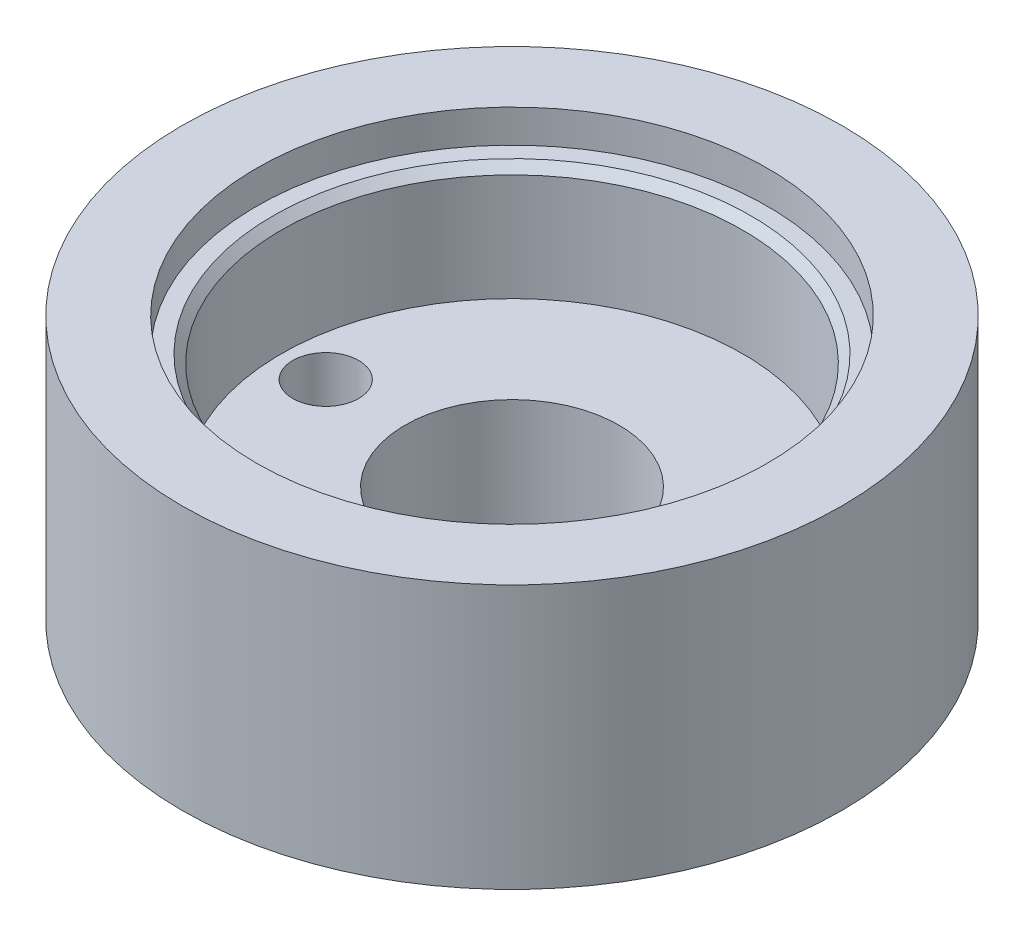
ISO-10303-21;
HEADER;
FILE_DESCRIPTION(('STEP AP214'),'2;1');
FILE_NAME('part.step','',(''),(''),'','','');
FILE_SCHEMA(('AUTOMOTIVE_DESIGN { 1 0 10303 214 1 1 1 1 }'));
ENDSEC;
DATA;
#1=APPLICATION_CONTEXT('core data for automotive mechanical design processes');
#2=APPLICATION_PROTOCOL_DEFINITION('international standard','automotive_design',2000,#1);
#3=PRODUCT_CONTEXT('',#1,'mechanical');
#4=PRODUCT('Part','Part','',(#3));
#5=PRODUCT_RELATED_PRODUCT_CATEGORY('part','',(#4));
#6=PRODUCT_DEFINITION_FORMATION('','',#4);
#7=PRODUCT_DEFINITION_CONTEXT('part definition',#1,'design');
#8=PRODUCT_DEFINITION('design','',#6,#7);
#9=PRODUCT_DEFINITION_SHAPE('','',#8);
#10=(LENGTH_UNIT() NAMED_UNIT(*) SI_UNIT(.MILLI.,.METRE.));
#11=(NAMED_UNIT(*) PLANE_ANGLE_UNIT() SI_UNIT($,.RADIAN.));
#12=(NAMED_UNIT(*) SI_UNIT($,.STERADIAN.) SOLID_ANGLE_UNIT());
#13=UNCERTAINTY_MEASURE_WITH_UNIT(LENGTH_MEASURE(1.E-05),#10,'distance_accuracy_value','');
#14=(GEOMETRIC_REPRESENTATION_CONTEXT(3) GLOBAL_UNCERTAINTY_ASSIGNED_CONTEXT((#13)) GLOBAL_UNIT_ASSIGNED_CONTEXT((#10,
#11,#12)) REPRESENTATION_CONTEXT('',''));
#15=CARTESIAN_POINT('',(0.,0.,0.));
#16=DIRECTION('',(0.,0.,1.));
#17=DIRECTION('',(1.,0.,0.));
#18=AXIS2_PLACEMENT_3D('',#15,#16,#17);
#19=CARTESIAN_POINT('',(0.,12.7,0.));
#20=DIRECTION('',(0.,1.,0.));
#21=DIRECTION('',(0.,0.,1.));
#22=AXIS2_PLACEMENT_3D('',#19,#20,#21);
#23=CYLINDRICAL_SURFACE('',#22,5.15873999999999);
#24=CARTESIAN_POINT('',(0.,0.,0.));
#25=DIRECTION('',(0.,1.,0.));
#26=DIRECTION('',(0.,0.,1.));
#27=AXIS2_PLACEMENT_3D('',#24,#25,#26);
#28=CIRCLE('',#27,5.15874);
#29=CARTESIAN_POINT('',(0.,0.,5.15874));
#30=VERTEX_POINT('',#29);
#31=EDGE_CURVE('E56',#30,#30,#28,.T.);
#32=ORIENTED_EDGE('',*,*,#31,.F.);
#33=EDGE_LOOP('',(#32));
#34=FACE_BOUND('',#33,.T.);
#35=CARTESIAN_POINT('',(0.,5.55625,0.));
#36=DIRECTION('',(0.,1.,0.));
#37=DIRECTION('',(0.,0.,1.));
#38=AXIS2_PLACEMENT_3D('',#35,#36,#37);
#39=CIRCLE('',#38,5.15873999999999);
#40=CARTESIAN_POINT('',(0.,5.55625,5.15873999999999));
#41=VERTEX_POINT('',#40);
#42=EDGE_CURVE('E61',#41,#41,#39,.F.);
#43=ORIENTED_EDGE('',*,*,#42,.F.);
#44=EDGE_LOOP('',(#43));
#45=FACE_BOUND('',#44,.T.);
#46=ADVANCED_FACE('F41',(#34,#45),#23,.F.);
#47=CARTESIAN_POINT('',(0.,12.7,0.));
#48=DIRECTION('',(0.,-1.,0.));
#49=DIRECTION('',(0.,0.,-1.));
#50=AXIS2_PLACEMENT_3D('',#47,#48,#49);
#51=CYLINDRICAL_SURFACE('',#50,15.875);
#52=CARTESIAN_POINT('',(0.,12.7,0.));
#53=DIRECTION('',(0.,1.,0.));
#54=DIRECTION('',(0.,0.,1.));
#55=AXIS2_PLACEMENT_3D('',#52,#53,#54);
#56=CIRCLE('',#55,15.875);
#57=CARTESIAN_POINT('',(0.,12.7,15.875));
#58=VERTEX_POINT('',#57);
#59=EDGE_CURVE('E10',#58,#58,#56,.T.);
#60=ORIENTED_EDGE('',*,*,#59,.F.);
#61=EDGE_LOOP('',(#60));
#62=FACE_BOUND('',#61,.T.);
#63=CARTESIAN_POINT('',(0.,0.,0.));
#64=DIRECTION('',(0.,1.,0.));
#65=DIRECTION('',(0.,0.,1.));
#66=AXIS2_PLACEMENT_3D('',#63,#64,#65);
#67=CIRCLE('',#66,15.875);
#68=CARTESIAN_POINT('',(0.,0.,15.875));
#69=VERTEX_POINT('',#68);
#70=EDGE_CURVE('E50',#69,#69,#67,.T.);
#71=ORIENTED_EDGE('',*,*,#70,.T.);
#72=EDGE_LOOP('',(#71));
#73=FACE_BOUND('',#72,.T.);
#74=ADVANCED_FACE('F43',(#62,#73),#51,.T.);
#75=CARTESIAN_POINT('',(0.,12.7,0.));
#76=DIRECTION('',(0.,1.,0.));
#77=DIRECTION('',(0.,0.,1.));
#78=AXIS2_PLACEMENT_3D('',#75,#76,#77);
#79=PLANE('',#78);
#80=CARTESIAN_POINT('',(0.,12.7,0.));
#81=DIRECTION('',(0.,1.,0.));
#82=DIRECTION('',(0.,0.,1.));
#83=AXIS2_PLACEMENT_3D('',#80,#81,#82);
#84=CIRCLE('',#83,12.303125);
#85=CARTESIAN_POINT('',(0.,12.7,12.303125));
#86=VERTEX_POINT('',#85);
#87=EDGE_CURVE('E83',#86,#86,#84,.T.);
#88=ORIENTED_EDGE('',*,*,#87,.F.);
#89=EDGE_LOOP('',(#88));
#90=FACE_BOUND('',#89,.T.);
#91=ORIENTED_EDGE('',*,*,#59,.T.);
#92=EDGE_LOOP('',(#91));
#93=FACE_BOUND('',#92,.T.);
#94=ADVANCED_FACE('F126',(#90,#93),#79,.T.);
#95=CARTESIAN_POINT('',(0.,0.,0.));
#96=DIRECTION('',(0.,1.,0.));
#97=DIRECTION('',(0.,0.,1.));
#98=AXIS2_PLACEMENT_3D('',#95,#96,#97);
#99=PLANE('',#98);
#100=CARTESIAN_POINT('',(-8.96873999999999,0.,0.));
#101=DIRECTION('',(0.,1.,0.));
#102=DIRECTION('',(0.,0.,1.));
#103=AXIS2_PLACEMENT_3D('',#100,#101,#102);
#104=CIRCLE('',#103,1.5875);
#105=CARTESIAN_POINT('',(-8.96873999999999,0.,1.5875));
#106=VERTEX_POINT('',#105);
#107=EDGE_CURVE('E78',#106,#106,#104,.F.);
#108=ORIENTED_EDGE('',*,*,#107,.F.);
#109=EDGE_LOOP('',(#108));
#110=FACE_BOUND('',#109,.T.);
#111=CARTESIAN_POINT('',(8.96873999999999,0.,0.));
#112=DIRECTION('',(0.,1.,0.));
#113=DIRECTION('',(0.,0.,1.));
#114=AXIS2_PLACEMENT_3D('',#111,#112,#113);
#115=CIRCLE('',#114,1.5875);
#116=CARTESIAN_POINT('',(8.96873999999999,0.,1.5875));
#117=VERTEX_POINT('',#116);
#118=EDGE_CURVE('E68',#117,#117,#115,.F.);
#119=ORIENTED_EDGE('',*,*,#118,.F.);
#120=EDGE_LOOP('',(#119));
#121=FACE_BOUND('',#120,.T.);
#122=ORIENTED_EDGE('',*,*,#31,.T.);
#123=EDGE_LOOP('',(#122));
#124=FACE_BOUND('',#123,.T.);
#125=ORIENTED_EDGE('',*,*,#70,.F.);
#126=EDGE_LOOP('',(#125));
#127=FACE_BOUND('',#126,.T.);
#128=ADVANCED_FACE('F115',(#110,#121,#124,#127),#99,.F.);
#129=CARTESIAN_POINT('',(0.,5.55625,0.));
#130=DIRECTION('',(0.,1.,0.));
#131=DIRECTION('',(0.,0.,1.));
#132=AXIS2_PLACEMENT_3D('',#129,#130,#131);
#133=PLANE('',#132);
#134=CARTESIAN_POINT('',(-8.96873999999999,5.55625,0.));
#135=DIRECTION('',(0.,1.,0.));
#136=DIRECTION('',(0.,0.,1.));
#137=AXIS2_PLACEMENT_3D('',#134,#135,#136);
#138=CIRCLE('',#137,1.5875);
#139=CARTESIAN_POINT('',(-8.96873999999999,5.55625,1.5875));
#140=VERTEX_POINT('',#139);
#141=EDGE_CURVE('E45',#140,#140,#138,.F.);
#142=ORIENTED_EDGE('',*,*,#141,.T.);
#143=EDGE_LOOP('',(#142));
#144=FACE_BOUND('',#143,.T.);
#145=CARTESIAN_POINT('',(8.96873999999999,5.55625,0.));
#146=DIRECTION('',(0.,1.,0.));
#147=DIRECTION('',(0.,0.,1.));
#148=AXIS2_PLACEMENT_3D('',#145,#146,#147);
#149=CIRCLE('',#148,1.5875);
#150=CARTESIAN_POINT('',(8.96873999999999,5.55625,1.5875));
#151=VERTEX_POINT('',#150);
#152=EDGE_CURVE('E65',#151,#151,#149,.F.);
#153=ORIENTED_EDGE('',*,*,#152,.T.);
#154=EDGE_LOOP('',(#153));
#155=FACE_BOUND('',#154,.T.);
#156=CARTESIAN_POINT('',(0.,5.55625,0.));
#157=DIRECTION('',(0.,1.,0.));
#158=DIRECTION('',(0.,0.,1.));
#159=AXIS2_PLACEMENT_3D('',#156,#157,#158);
#160=CIRCLE('',#159,11.1125);
#161=CARTESIAN_POINT('',(0.,5.55625,11.1125));
#162=VERTEX_POINT('',#161);
#163=EDGE_CURVE('E88',#162,#162,#160,.T.);
#164=ORIENTED_EDGE('',*,*,#163,.T.);
#165=EDGE_LOOP('',(#164));
#166=FACE_BOUND('',#165,.T.);
#167=ORIENTED_EDGE('',*,*,#42,.T.);
#168=EDGE_LOOP('',(#167));
#169=FACE_BOUND('',#168,.T.);
#170=ADVANCED_FACE('F109',(#144,#155,#166,#169),#133,.T.);
#171=CARTESIAN_POINT('',(0.,12.7,0.));
#172=DIRECTION('',(0.,-1.,0.));
#173=DIRECTION('',(0.,0.,-1.));
#174=AXIS2_PLACEMENT_3D('',#171,#172,#173);
#175=CYLINDRICAL_SURFACE('',#174,11.1125);
#176=CARTESIAN_POINT('',(0.,10.715625,0.));
#177=DIRECTION('',(0.,1.,0.));
#178=DIRECTION('',(0.,0.,1.));
#179=AXIS2_PLACEMENT_3D('',#176,#177,#178);
#180=CIRCLE('',#179,11.1125);
#181=CARTESIAN_POINT('',(0.,10.715625,11.1125));
#182=VERTEX_POINT('',#181);
#183=EDGE_CURVE('E64',#182,#182,#180,.F.);
#184=ORIENTED_EDGE('',*,*,#183,.F.);
#185=EDGE_LOOP('',(#184));
#186=FACE_BOUND('',#185,.T.);
#187=ORIENTED_EDGE('',*,*,#163,.F.);
#188=EDGE_LOOP('',(#187));
#189=FACE_BOUND('',#188,.T.);
#190=ADVANCED_FACE('F105',(#186,#189),#175,.F.);
#191=CARTESIAN_POINT('',(0.,11.1125,0.));
#192=DIRECTION('',(0.,1.,0.));
#193=DIRECTION('',(0.,0.,1.));
#194=AXIS2_PLACEMENT_3D('',#191,#192,#193);
#195=CYLINDRICAL_SURFACE('',#194,12.303125);
#196=CARTESIAN_POINT('',(0.,11.1125,0.));
#197=DIRECTION('',(0.,1.,0.));
#198=DIRECTION('',(0.,0.,1.));
#199=AXIS2_PLACEMENT_3D('',#196,#197,#198);
#200=CIRCLE('',#199,12.303125);
#201=CARTESIAN_POINT('',(0.,11.1125,12.303125));
#202=VERTEX_POINT('',#201);
#203=EDGE_CURVE('E84',#202,#202,#200,.T.);
#204=ORIENTED_EDGE('',*,*,#203,.F.);
#205=EDGE_LOOP('',(#204));
#206=FACE_BOUND('',#205,.T.);
#207=ORIENTED_EDGE('',*,*,#87,.T.);
#208=EDGE_LOOP('',(#207));
#209=FACE_BOUND('',#208,.T.);
#210=ADVANCED_FACE('F108',(#206,#209),#195,.F.);
#211=CARTESIAN_POINT('',(0.,11.1125,0.));
#212=DIRECTION('',(0.,1.,0.));
#213=DIRECTION('',(0.,0.,1.));
#214=AXIS2_PLACEMENT_3D('',#211,#212,#213);
#215=PLANE('',#214);
#216=CARTESIAN_POINT('',(0.,11.1125,0.));
#217=DIRECTION('',(0.,1.,0.));
#218=DIRECTION('',(0.,0.,1.));
#219=AXIS2_PLACEMENT_3D('',#216,#217,#218);
#220=CIRCLE('',#219,11.509375);
#221=CARTESIAN_POINT('',(0.,11.1125,11.509375));
#222=VERTEX_POINT('',#221);
#223=EDGE_CURVE('E95',#222,#222,#220,.T.);
#224=ORIENTED_EDGE('',*,*,#223,.F.);
#225=EDGE_LOOP('',(#224));
#226=FACE_BOUND('',#225,.T.);
#227=ORIENTED_EDGE('',*,*,#203,.T.);
#228=EDGE_LOOP('',(#227));
#229=FACE_BOUND('',#228,.T.);
#230=ADVANCED_FACE('F159',(#226,#229),#215,.T.);
#231=CARTESIAN_POINT('',(0.,11.1125,0.));
#232=DIRECTION('',(0.,1.,0.));
#233=DIRECTION('',(0.,0.,1.));
#234=AXIS2_PLACEMENT_3D('',#231,#232,#233);
#235=CONICAL_SURFACE('',#234,11.509375,0.785398163397453);
#236=ORIENTED_EDGE('',*,*,#183,.T.);
#237=EDGE_LOOP('',(#236));
#238=FACE_BOUND('',#237,.T.);
#239=ORIENTED_EDGE('',*,*,#223,.T.);
#240=EDGE_LOOP('',(#239));
#241=FACE_BOUND('',#240,.T.);
#242=ADVANCED_FACE('F102',(#238,#241),#235,.F.);
#243=CARTESIAN_POINT('',(8.96873999999999,12.7,0.));
#244=DIRECTION('',(0.,-1.,0.));
#245=DIRECTION('',(0.,0.,-1.));
#246=AXIS2_PLACEMENT_3D('',#243,#244,#245);
#247=CYLINDRICAL_SURFACE('',#246,1.5875);
#248=ORIENTED_EDGE('',*,*,#152,.F.);
#249=EDGE_LOOP('',(#248));
#250=FACE_BOUND('',#249,.T.);
#251=ORIENTED_EDGE('',*,*,#118,.T.);
#252=EDGE_LOOP('',(#251));
#253=FACE_BOUND('',#252,.T.);
#254=ADVANCED_FACE('F149',(#250,#253),#247,.F.);
#255=CARTESIAN_POINT('',(-8.96873999999999,12.7,0.));
#256=DIRECTION('',(0.,-1.,0.));
#257=DIRECTION('',(0.,0.,-1.));
#258=AXIS2_PLACEMENT_3D('',#255,#256,#257);
#259=CYLINDRICAL_SURFACE('',#258,1.5875);
#260=ORIENTED_EDGE('',*,*,#141,.F.);
#261=EDGE_LOOP('',(#260));
#262=FACE_BOUND('',#261,.T.);
#263=ORIENTED_EDGE('',*,*,#107,.T.);
#264=EDGE_LOOP('',(#263));
#265=FACE_BOUND('',#264,.T.);
#266=ADVANCED_FACE('F147',(#262,#265),#259,.F.);
#267=CLOSED_SHELL('',(#46,#74,#94,#128,#170,#190,#210,#230,#242,#254,#266));
#268=MANIFOLD_SOLID_BREP('B2',#267);
#269=ADVANCED_BREP_SHAPE_REPRESENTATION('',(#18,#268),#14);
#270=SHAPE_DEFINITION_REPRESENTATION(#9,#269);
ENDSEC;
END-ISO-10303-21;
